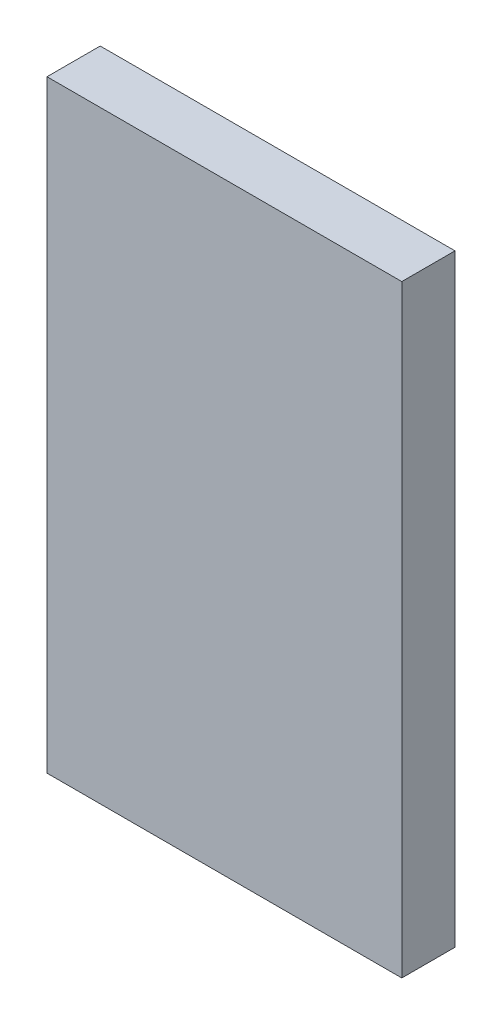
ISO-10303-21;
HEADER;
FILE_DESCRIPTION(('STEP AP214'),'2;1');
FILE_NAME('part.step','',(''),(''),'','','');
FILE_SCHEMA(('AUTOMOTIVE_DESIGN { 1 0 10303 214 1 1 1 1 }'));
ENDSEC;
DATA;
#1=APPLICATION_CONTEXT('core data for automotive mechanical design processes');
#2=APPLICATION_PROTOCOL_DEFINITION('international standard','automotive_design',2000,#1);
#3=PRODUCT_CONTEXT('',#1,'mechanical');
#4=PRODUCT('Part','Part','',(#3));
#5=PRODUCT_RELATED_PRODUCT_CATEGORY('part','',(#4));
#6=PRODUCT_DEFINITION_FORMATION('','',#4);
#7=PRODUCT_DEFINITION_CONTEXT('part definition',#1,'design');
#8=PRODUCT_DEFINITION('design','',#6,#7);
#9=PRODUCT_DEFINITION_SHAPE('','',#8);
#10=(LENGTH_UNIT() NAMED_UNIT(*) SI_UNIT(.MILLI.,.METRE.));
#11=(NAMED_UNIT(*) PLANE_ANGLE_UNIT() SI_UNIT($,.RADIAN.));
#12=(NAMED_UNIT(*) SI_UNIT($,.STERADIAN.) SOLID_ANGLE_UNIT());
#13=UNCERTAINTY_MEASURE_WITH_UNIT(LENGTH_MEASURE(1.E-05),#10,'distance_accuracy_value','');
#14=(GEOMETRIC_REPRESENTATION_CONTEXT(3) GLOBAL_UNCERTAINTY_ASSIGNED_CONTEXT((#13)) GLOBAL_UNIT_ASSIGNED_CONTEXT((#10,
#11,#12)) REPRESENTATION_CONTEXT('',''));
#15=CARTESIAN_POINT('',(0.,0.,0.));
#16=DIRECTION('',(0.,0.,1.));
#17=DIRECTION('',(1.,0.,0.));
#18=AXIS2_PLACEMENT_3D('',#15,#16,#17);
#19=CARTESIAN_POINT('',(0.,34.,3.));
#20=DIRECTION('',(0.,-1.,0.));
#21=DIRECTION('',(0.,0.,-1.));
#22=AXIS2_PLACEMENT_3D('',#19,#20,#21);
#23=PLANE('',#22);
#24=DIRECTION('',(-1.,0.,0.));
#25=VECTOR('',#24,1.);
#26=CARTESIAN_POINT('',(0.,34.,0.));
#27=LINE('',#26,#25);
#28=CARTESIAN_POINT('',(20.,34.,0.));
#29=VERTEX_POINT('',#28);
#30=CARTESIAN_POINT('',(0.,34.,0.));
#31=VERTEX_POINT('',#30);
#32=EDGE_CURVE('E96',#29,#31,#27,.T.);
#33=ORIENTED_EDGE('',*,*,#32,.T.);
#34=DIRECTION('',(0.,0.,-1.));
#35=VECTOR('',#34,1.);
#36=CARTESIAN_POINT('',(0.,34.,3.));
#37=LINE('',#36,#35);
#38=CARTESIAN_POINT('',(0.,34.,3.));
#39=VERTEX_POINT('',#38);
#40=EDGE_CURVE('E11',#39,#31,#37,.T.);
#41=ORIENTED_EDGE('',*,*,#40,.F.);
#42=DIRECTION('',(-1.,0.,0.));
#43=VECTOR('',#42,1.);
#44=CARTESIAN_POINT('',(0.,34.,3.));
#45=LINE('',#44,#43);
#46=CARTESIAN_POINT('',(20.,34.,3.));
#47=VERTEX_POINT('',#46);
#48=EDGE_CURVE('E84',#47,#39,#45,.T.);
#49=ORIENTED_EDGE('',*,*,#48,.F.);
#50=DIRECTION('',(0.,0.,-1.));
#51=VECTOR('',#50,1.);
#52=CARTESIAN_POINT('',(20.,34.,3.));
#53=LINE('',#52,#51);
#54=EDGE_CURVE('E92',#47,#29,#53,.T.);
#55=ORIENTED_EDGE('',*,*,#54,.T.);
#56=EDGE_LOOP('',(#33,#41,#49,#55));
#57=FACE_BOUND('',#56,.T.);
#58=ADVANCED_FACE('F33',(#57),#23,.F.);
#59=CARTESIAN_POINT('',(0.,34.,3.));
#60=DIRECTION('',(1.,0.,0.));
#61=DIRECTION('',(0.,1.,0.));
#62=AXIS2_PLACEMENT_3D('',#59,#60,#61);
#63=PLANE('',#62);
#64=DIRECTION('',(0.,-1.,0.));
#65=VECTOR('',#64,1.);
#66=CARTESIAN_POINT('',(0.,34.,0.));
#67=LINE('',#66,#65);
#68=CARTESIAN_POINT('',(0.,0.,0.));
#69=VERTEX_POINT('',#68);
#70=EDGE_CURVE('E88',#31,#69,#67,.T.);
#71=ORIENTED_EDGE('',*,*,#70,.T.);
#72=DIRECTION('',(0.,0.,-1.));
#73=VECTOR('',#72,1.);
#74=CARTESIAN_POINT('',(0.,0.,3.));
#75=LINE('',#74,#73);
#76=CARTESIAN_POINT('',(0.,0.,3.));
#77=VERTEX_POINT('',#76);
#78=EDGE_CURVE('E41',#77,#69,#75,.T.);
#79=ORIENTED_EDGE('',*,*,#78,.F.);
#80=DIRECTION('',(0.,-1.,0.));
#81=VECTOR('',#80,1.);
#82=CARTESIAN_POINT('',(0.,34.,3.));
#83=LINE('',#82,#81);
#84=EDGE_CURVE('E79',#39,#77,#83,.T.);
#85=ORIENTED_EDGE('',*,*,#84,.F.);
#86=ORIENTED_EDGE('',*,*,#40,.T.);
#87=EDGE_LOOP('',(#71,#79,#85,#86));
#88=FACE_BOUND('',#87,.T.);
#89=ADVANCED_FACE('F87',(#88),#63,.F.);
#90=CARTESIAN_POINT('',(20.,0.,3.));
#91=DIRECTION('',(0.,1.,0.));
#92=DIRECTION('',(-1.,0.,0.));
#93=AXIS2_PLACEMENT_3D('',#90,#91,#92);
#94=PLANE('',#93);
#95=DIRECTION('',(1.,0.,0.));
#96=VECTOR('',#95,1.);
#97=CARTESIAN_POINT('',(20.,0.,0.));
#98=LINE('',#97,#96);
#99=CARTESIAN_POINT('',(20.,0.,0.));
#100=VERTEX_POINT('',#99);
#101=EDGE_CURVE('E66',#69,#100,#98,.T.);
#102=ORIENTED_EDGE('',*,*,#101,.T.);
#103=DIRECTION('',(0.,0.,-1.));
#104=VECTOR('',#103,1.);
#105=CARTESIAN_POINT('',(20.,0.,3.));
#106=LINE('',#105,#104);
#107=CARTESIAN_POINT('',(20.,0.,3.));
#108=VERTEX_POINT('',#107);
#109=EDGE_CURVE('E89',#108,#100,#106,.T.);
#110=ORIENTED_EDGE('',*,*,#109,.F.);
#111=DIRECTION('',(1.,0.,0.));
#112=VECTOR('',#111,1.);
#113=CARTESIAN_POINT('',(20.,0.,3.));
#114=LINE('',#113,#112);
#115=EDGE_CURVE('E82',#77,#108,#114,.T.);
#116=ORIENTED_EDGE('',*,*,#115,.F.);
#117=ORIENTED_EDGE('',*,*,#78,.T.);
#118=EDGE_LOOP('',(#102,#110,#116,#117));
#119=FACE_BOUND('',#118,.T.);
#120=ADVANCED_FACE('F90',(#119),#94,.F.);
#121=CARTESIAN_POINT('',(20.,34.,3.));
#122=DIRECTION('',(-1.,0.,0.));
#123=DIRECTION('',(0.,-1.,0.));
#124=AXIS2_PLACEMENT_3D('',#121,#122,#123);
#125=PLANE('',#124);
#126=DIRECTION('',(0.,1.,0.));
#127=VECTOR('',#126,1.);
#128=CARTESIAN_POINT('',(20.,34.,0.));
#129=LINE('',#128,#127);
#130=EDGE_CURVE('E72',#100,#29,#129,.T.);
#131=ORIENTED_EDGE('',*,*,#130,.T.);
#132=ORIENTED_EDGE('',*,*,#54,.F.);
#133=DIRECTION('',(0.,1.,0.));
#134=VECTOR('',#133,1.);
#135=CARTESIAN_POINT('',(20.,34.,3.));
#136=LINE('',#135,#134);
#137=EDGE_CURVE('E49',#108,#47,#136,.T.);
#138=ORIENTED_EDGE('',*,*,#137,.F.);
#139=ORIENTED_EDGE('',*,*,#109,.T.);
#140=EDGE_LOOP('',(#131,#132,#138,#139));
#141=FACE_BOUND('',#140,.T.);
#142=ADVANCED_FACE('F103',(#141),#125,.F.);
#143=CARTESIAN_POINT('',(0.,0.,3.));
#144=DIRECTION('',(0.,0.,-1.));
#145=DIRECTION('',(-1.,0.,0.));
#146=AXIS2_PLACEMENT_3D('',#143,#144,#145);
#147=PLANE('',#146);
#148=ORIENTED_EDGE('',*,*,#48,.T.);
#149=ORIENTED_EDGE('',*,*,#84,.T.);
#150=ORIENTED_EDGE('',*,*,#115,.T.);
#151=ORIENTED_EDGE('',*,*,#137,.T.);
#152=EDGE_LOOP('',(#148,#149,#150,#151));
#153=FACE_BOUND('',#152,.T.);
#154=ADVANCED_FACE('F80',(#153),#147,.F.);
#155=CARTESIAN_POINT('',(0.,0.,0.));
#156=DIRECTION('',(0.,0.,-1.));
#157=DIRECTION('',(-1.,0.,0.));
#158=AXIS2_PLACEMENT_3D('',#155,#156,#157);
#159=PLANE('',#158);
#160=ORIENTED_EDGE('',*,*,#32,.F.);
#161=ORIENTED_EDGE('',*,*,#130,.F.);
#162=ORIENTED_EDGE('',*,*,#101,.F.);
#163=ORIENTED_EDGE('',*,*,#70,.F.);
#164=EDGE_LOOP('',(#160,#161,#162,#163));
#165=FACE_BOUND('',#164,.T.);
#166=ADVANCED_FACE('F106',(#165),#159,.T.);
#167=CLOSED_SHELL('',(#58,#89,#120,#142,#154,#166));
#168=MANIFOLD_SOLID_BREP('B2',#167);
#169=ADVANCED_BREP_SHAPE_REPRESENTATION('',(#18,#168),#14);
#170=SHAPE_DEFINITION_REPRESENTATION(#9,#169);
ENDSEC;
END-ISO-10303-21;
